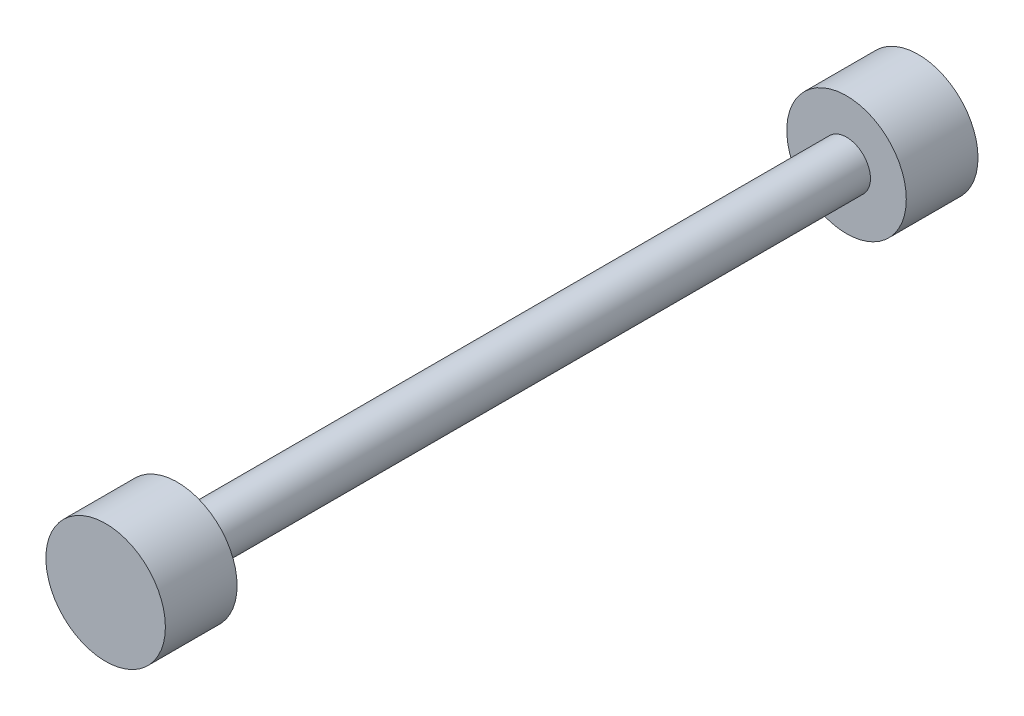
ISO-10303-21;
HEADER;
FILE_DESCRIPTION(('STEP AP214'),'2;1');
FILE_NAME('part.step','',(''),(''),'','','');
FILE_SCHEMA(('AUTOMOTIVE_DESIGN { 1 0 10303 214 1 1 1 1 }'));
ENDSEC;
DATA;
#1=APPLICATION_CONTEXT('core data for automotive mechanical design processes');
#2=APPLICATION_PROTOCOL_DEFINITION('international standard','automotive_design',2000,#1);
#3=PRODUCT_CONTEXT('',#1,'mechanical');
#4=PRODUCT('Part','Part','',(#3));
#5=PRODUCT_RELATED_PRODUCT_CATEGORY('part','',(#4));
#6=PRODUCT_DEFINITION_FORMATION('','',#4);
#7=PRODUCT_DEFINITION_CONTEXT('part definition',#1,'design');
#8=PRODUCT_DEFINITION('design','',#6,#7);
#9=PRODUCT_DEFINITION_SHAPE('','',#8);
#10=(LENGTH_UNIT() NAMED_UNIT(*) SI_UNIT(.MILLI.,.METRE.));
#11=(NAMED_UNIT(*) PLANE_ANGLE_UNIT() SI_UNIT($,.RADIAN.));
#12=(NAMED_UNIT(*) SI_UNIT($,.STERADIAN.) SOLID_ANGLE_UNIT());
#13=UNCERTAINTY_MEASURE_WITH_UNIT(LENGTH_MEASURE(1.E-05),#10,'distance_accuracy_value','');
#14=(GEOMETRIC_REPRESENTATION_CONTEXT(3) GLOBAL_UNCERTAINTY_ASSIGNED_CONTEXT((#13)) GLOBAL_UNIT_ASSIGNED_CONTEXT((#10,
#11,#12)) REPRESENTATION_CONTEXT('',''));
#15=CARTESIAN_POINT('',(0.,0.,0.));
#16=DIRECTION('',(0.,0.,1.));
#17=DIRECTION('',(1.,0.,0.));
#18=AXIS2_PLACEMENT_3D('',#15,#16,#17);
#19=CARTESIAN_POINT('',(0.,0.,19.05));
#20=DIRECTION('',(0.,0.,-1.));
#21=DIRECTION('',(-1.,0.,0.));
#22=AXIS2_PLACEMENT_3D('',#19,#20,#21);
#23=CYLINDRICAL_SURFACE('',#22,15.875);
#24=CARTESIAN_POINT('',(0.,0.,19.05));
#25=DIRECTION('',(0.,0.,1.));
#26=DIRECTION('',(1.,0.,0.));
#27=AXIS2_PLACEMENT_3D('',#24,#25,#26);
#28=CIRCLE('',#27,15.875);
#29=CARTESIAN_POINT('',(15.875,0.,19.05));
#30=VERTEX_POINT('',#29);
#31=EDGE_CURVE('E10',#30,#30,#28,.T.);
#32=ORIENTED_EDGE('',*,*,#31,.F.);
#33=EDGE_LOOP('',(#32));
#34=FACE_BOUND('',#33,.T.);
#35=CARTESIAN_POINT('',(0.,0.,0.));
#36=DIRECTION('',(0.,0.,1.));
#37=DIRECTION('',(1.,0.,0.));
#38=AXIS2_PLACEMENT_3D('',#35,#36,#37);
#39=CIRCLE('',#38,15.875);
#40=CARTESIAN_POINT('',(15.875,0.,0.));
#41=VERTEX_POINT('',#40);
#42=EDGE_CURVE('E33',#41,#41,#39,.T.);
#43=ORIENTED_EDGE('',*,*,#42,.T.);
#44=EDGE_LOOP('',(#43));
#45=FACE_BOUND('',#44,.T.);
#46=ADVANCED_FACE('F30',(#34,#45),#23,.T.);
#47=CARTESIAN_POINT('',(0.,0.,19.05));
#48=DIRECTION('',(0.,0.,1.));
#49=DIRECTION('',(1.,0.,0.));
#50=AXIS2_PLACEMENT_3D('',#47,#48,#49);
#51=PLANE('',#50);
#52=CARTESIAN_POINT('',(0.,0.,19.05));
#53=DIRECTION('',(0.,0.,1.));
#54=DIRECTION('',(1.,0.,0.));
#55=AXIS2_PLACEMENT_3D('',#52,#53,#54);
#56=CIRCLE('',#55,6.35);
#57=CARTESIAN_POINT('',(6.35,0.,19.05));
#58=VERTEX_POINT('',#57);
#59=EDGE_CURVE('E42',#58,#58,#56,.T.);
#60=ORIENTED_EDGE('',*,*,#59,.F.);
#61=EDGE_LOOP('',(#60));
#62=FACE_BOUND('',#61,.T.);
#63=ORIENTED_EDGE('',*,*,#31,.T.);
#64=EDGE_LOOP('',(#63));
#65=FACE_BOUND('',#64,.T.);
#66=ADVANCED_FACE('F72',(#62,#65),#51,.T.);
#67=CARTESIAN_POINT('',(0.,0.,0.));
#68=DIRECTION('',(0.,0.,1.));
#69=DIRECTION('',(1.,0.,0.));
#70=AXIS2_PLACEMENT_3D('',#67,#68,#69);
#71=PLANE('',#70);
#72=ORIENTED_EDGE('',*,*,#42,.F.);
#73=EDGE_LOOP('',(#72));
#74=FACE_BOUND('',#73,.T.);
#75=ADVANCED_FACE('F77',(#74),#71,.F.);
#76=CARTESIAN_POINT('',(0.,0.,196.85));
#77=DIRECTION('',(0.,0.,-1.));
#78=DIRECTION('',(-1.,0.,0.));
#79=AXIS2_PLACEMENT_3D('',#76,#77,#78);
#80=CYLINDRICAL_SURFACE('',#79,6.35);
#81=CARTESIAN_POINT('',(0.,0.,196.85));
#82=DIRECTION('',(0.,0.,1.));
#83=DIRECTION('',(1.,0.,0.));
#84=AXIS2_PLACEMENT_3D('',#81,#82,#83);
#85=CIRCLE('',#84,6.35);
#86=CARTESIAN_POINT('',(6.35,0.,196.85));
#87=VERTEX_POINT('',#86);
#88=EDGE_CURVE('E40',#87,#87,#85,.T.);
#89=ORIENTED_EDGE('',*,*,#88,.F.);
#90=EDGE_LOOP('',(#89));
#91=FACE_BOUND('',#90,.T.);
#92=ORIENTED_EDGE('',*,*,#59,.T.);
#93=EDGE_LOOP('',(#92));
#94=FACE_BOUND('',#93,.T.);
#95=ADVANCED_FACE('F59',(#91,#94),#80,.T.);
#96=CARTESIAN_POINT('',(0.,0.,215.9));
#97=DIRECTION('',(0.,0.,-1.));
#98=DIRECTION('',(-1.,0.,0.));
#99=AXIS2_PLACEMENT_3D('',#96,#97,#98);
#100=CYLINDRICAL_SURFACE('',#99,15.875);
#101=CARTESIAN_POINT('',(0.,0.,215.9));
#102=DIRECTION('',(0.,0.,1.));
#103=DIRECTION('',(1.,0.,0.));
#104=AXIS2_PLACEMENT_3D('',#101,#102,#103);
#105=CIRCLE('',#104,15.875);
#106=CARTESIAN_POINT('',(15.875,0.,215.9));
#107=VERTEX_POINT('',#106);
#108=EDGE_CURVE('E45',#107,#107,#105,.T.);
#109=ORIENTED_EDGE('',*,*,#108,.F.);
#110=EDGE_LOOP('',(#109));
#111=FACE_BOUND('',#110,.T.);
#112=CARTESIAN_POINT('',(0.,0.,196.85));
#113=DIRECTION('',(0.,0.,1.));
#114=DIRECTION('',(1.,0.,0.));
#115=AXIS2_PLACEMENT_3D('',#112,#113,#114);
#116=CIRCLE('',#115,15.875);
#117=CARTESIAN_POINT('',(15.875,0.,196.85));
#118=VERTEX_POINT('',#117);
#119=EDGE_CURVE('E48',#118,#118,#116,.T.);
#120=ORIENTED_EDGE('',*,*,#119,.T.);
#121=EDGE_LOOP('',(#120));
#122=FACE_BOUND('',#121,.T.);
#123=ADVANCED_FACE('F56',(#111,#122),#100,.T.);
#124=CARTESIAN_POINT('',(0.,0.,215.9));
#125=DIRECTION('',(0.,0.,1.));
#126=DIRECTION('',(1.,0.,0.));
#127=AXIS2_PLACEMENT_3D('',#124,#125,#126);
#128=PLANE('',#127);
#129=ORIENTED_EDGE('',*,*,#108,.T.);
#130=EDGE_LOOP('',(#129));
#131=FACE_BOUND('',#130,.T.);
#132=ADVANCED_FACE('F54',(#131),#128,.T.);
#133=CARTESIAN_POINT('',(0.,0.,196.85));
#134=DIRECTION('',(0.,0.,1.));
#135=DIRECTION('',(1.,0.,0.));
#136=AXIS2_PLACEMENT_3D('',#133,#134,#135);
#137=PLANE('',#136);
#138=ORIENTED_EDGE('',*,*,#88,.T.);
#139=EDGE_LOOP('',(#138));
#140=FACE_BOUND('',#139,.T.);
#141=ORIENTED_EDGE('',*,*,#119,.F.);
#142=EDGE_LOOP('',(#141));
#143=FACE_BOUND('',#142,.T.);
#144=ADVANCED_FACE('F63',(#140,#143),#137,.F.);
#145=CLOSED_SHELL('',(#46,#66,#75,#95,#123,#132,#144));
#146=MANIFOLD_SOLID_BREP('B2',#145);
#147=ADVANCED_BREP_SHAPE_REPRESENTATION('',(#18,#146),#14);
#148=SHAPE_DEFINITION_REPRESENTATION(#9,#147);
ENDSEC;
END-ISO-10303-21;
